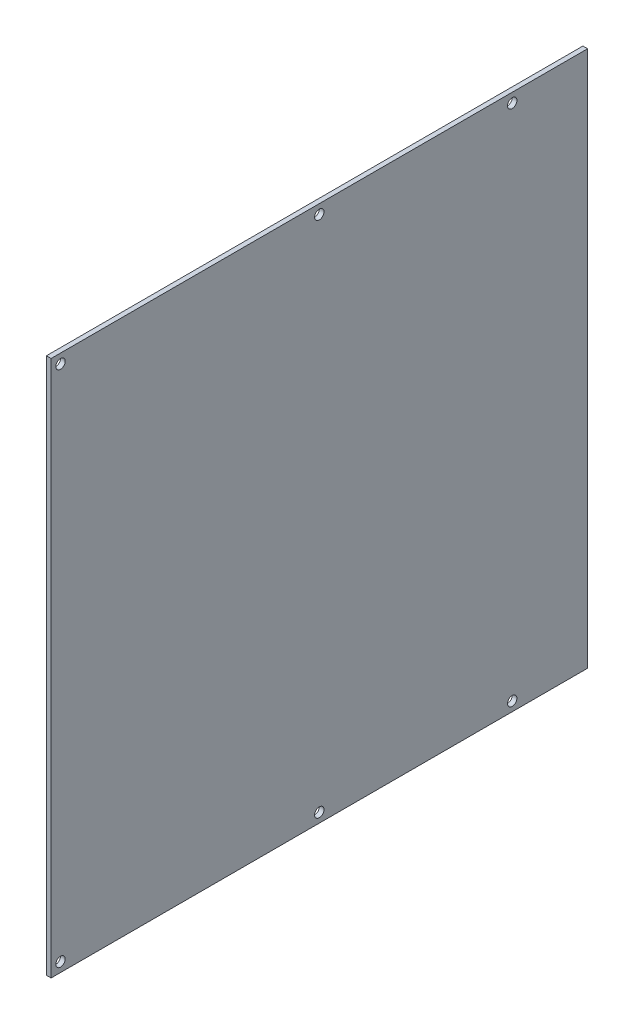
ISO-10303-21;
HEADER;
FILE_DESCRIPTION(('STEP AP214'),'2;1');
FILE_NAME('part.step','',(''),(''),'','','');
FILE_SCHEMA(('AUTOMOTIVE_DESIGN { 1 0 10303 214 1 1 1 1 }'));
ENDSEC;
DATA;
#1=APPLICATION_CONTEXT('core data for automotive mechanical design processes');
#2=APPLICATION_PROTOCOL_DEFINITION('international standard','automotive_design',2000,#1);
#3=PRODUCT_CONTEXT('',#1,'mechanical');
#4=PRODUCT('Part','Part','',(#3));
#5=PRODUCT_RELATED_PRODUCT_CATEGORY('part','',(#4));
#6=PRODUCT_DEFINITION_FORMATION('','',#4);
#7=PRODUCT_DEFINITION_CONTEXT('part definition',#1,'design');
#8=PRODUCT_DEFINITION('design','',#6,#7);
#9=PRODUCT_DEFINITION_SHAPE('','',#8);
#10=(LENGTH_UNIT() NAMED_UNIT(*) SI_UNIT(.MILLI.,.METRE.));
#11=(NAMED_UNIT(*) PLANE_ANGLE_UNIT() SI_UNIT($,.RADIAN.));
#12=(NAMED_UNIT(*) SI_UNIT($,.STERADIAN.) SOLID_ANGLE_UNIT());
#13=UNCERTAINTY_MEASURE_WITH_UNIT(LENGTH_MEASURE(1.E-05),#10,'distance_accuracy_value','');
#14=(GEOMETRIC_REPRESENTATION_CONTEXT(3) GLOBAL_UNCERTAINTY_ASSIGNED_CONTEXT((#13)) GLOBAL_UNIT_ASSIGNED_CONTEXT((#10,
#11,#12)) REPRESENTATION_CONTEXT('',''));
#15=CARTESIAN_POINT('',(0.,0.,0.));
#16=DIRECTION('',(0.,0.,1.));
#17=DIRECTION('',(1.,0.,0.));
#18=AXIS2_PLACEMENT_3D('',#15,#16,#17);
#19=CARTESIAN_POINT('',(-1219.2,177.877193641291,1597.025));
#20=DIRECTION('',(-1.,0.,0.));
#21=DIRECTION('',(0.,-1.,0.));
#22=AXIS2_PLACEMENT_3D('',#19,#20,#21);
#23=PLANE('',#22);
#24=CARTESIAN_POINT('',(-1219.2,352.50219364129,1771.65));
#25=DIRECTION('',(1.,0.,0.));
#26=DIRECTION('',(0.,1.,0.));
#27=AXIS2_PLACEMENT_3D('',#24,#25,#26);
#28=CIRCLE('',#27,3.175);
#29=CARTESIAN_POINT('',(-1219.2,355.67719364129,1771.65));
#30=VERTEX_POINT('',#29);
#31=EDGE_CURVE('E102',#30,#30,#28,.F.);
#32=ORIENTED_EDGE('',*,*,#31,.T.);
#33=EDGE_LOOP('',(#32));
#34=FACE_BOUND('',#33,.T.);
#35=CARTESIAN_POINT('',(-1219.2,352.50219364129,1466.91491037368));
#36=DIRECTION('',(1.,0.,0.));
#37=DIRECTION('',(0.,1.,0.));
#38=AXIS2_PLACEMENT_3D('',#35,#36,#37);
#39=CIRCLE('',#38,3.175);
#40=CARTESIAN_POINT('',(-1219.2,355.67719364129,1466.91491037368));
#41=VERTEX_POINT('',#40);
#42=EDGE_CURVE('E72',#41,#41,#39,.F.);
#43=ORIENTED_EDGE('',*,*,#42,.T.);
#44=EDGE_LOOP('',(#43));
#45=FACE_BOUND('',#44,.T.);
#46=CARTESIAN_POINT('',(-1219.2,352.50219364129,1597.06330442429));
#47=DIRECTION('',(1.,0.,0.));
#48=DIRECTION('',(0.,1.,0.));
#49=AXIS2_PLACEMENT_3D('',#46,#47,#48);
#50=CIRCLE('',#49,3.175);
#51=CARTESIAN_POINT('',(-1219.2,355.67719364129,1597.06330442429));
#52=VERTEX_POINT('',#51);
#53=EDGE_CURVE('E105',#52,#52,#50,.F.);
#54=ORIENTED_EDGE('',*,*,#53,.T.);
#55=EDGE_LOOP('',(#54));
#56=FACE_BOUND('',#55,.T.);
#57=DIRECTION('',(0.,0.,1.));
#58=VECTOR('',#57,1.);
#59=CARTESIAN_POINT('',(-1219.2,358.852193641291,1597.025));
#60=LINE('',#59,#58);
#61=CARTESIAN_POINT('',(-1219.2,358.852193641291,1416.05));
#62=VERTEX_POINT('',#61);
#63=CARTESIAN_POINT('',(-1219.2,358.852193641291,1778.));
#64=VERTEX_POINT('',#63);
#65=EDGE_CURVE('E111',#62,#64,#60,.T.);
#66=ORIENTED_EDGE('',*,*,#65,.T.);
#67=DIRECTION('',(0.,1.,0.));
#68=VECTOR('',#67,1.);
#69=CARTESIAN_POINT('',(-1219.2,179.3875,1778.));
#70=LINE('',#69,#68);
#71=CARTESIAN_POINT('',(-1219.2,-3.0978063587097,1778.));
#72=VERTEX_POINT('',#71);
#73=EDGE_CURVE('E296',#72,#64,#70,.T.);
#74=ORIENTED_EDGE('',*,*,#73,.F.);
#75=DIRECTION('',(0.,0.,1.));
#76=VECTOR('',#75,1.);
#77=CARTESIAN_POINT('',(-1219.2,-3.0978063587097,1597.61381511689));
#78=LINE('',#77,#76);
#79=CARTESIAN_POINT('',(-1219.2,-3.09780635870967,1416.12660884857));
#80=VERTEX_POINT('',#79);
#81=EDGE_CURVE('E58',#80,#72,#78,.T.);
#82=ORIENTED_EDGE('',*,*,#81,.F.);
#83=DIRECTION('',(0.,-0.999694352960379,0.0247224727551606));
#84=VECTOR('',#83,1.);
#85=CARTESIAN_POINT('',(-1219.2,-1.5489031793547,1416.08830442429));
#86=LINE('',#85,#84);
#87=CARTESIAN_POINT('',(-1219.2,3.33473438642795E-13,1416.05));
#88=VERTEX_POINT('',#87);
#89=EDGE_CURVE('E74',#80,#88,#86,.F.);
#90=ORIENTED_EDGE('',*,*,#89,.T.);
#91=DIRECTION('',(0.,1.,0.));
#92=VECTOR('',#91,1.);
#93=CARTESIAN_POINT('',(-1219.2,179.3875,1416.05));
#94=LINE('',#93,#92);
#95=EDGE_CURVE('E63',#88,#62,#94,.T.);
#96=ORIENTED_EDGE('',*,*,#95,.T.);
#97=EDGE_LOOP('',(#66,#74,#82,#90,#96));
#98=FACE_BOUND('',#97,.T.);
#99=CARTESIAN_POINT('',(-1219.2,3.25219364129064,1771.65));
#100=DIRECTION('',(1.,0.,0.));
#101=DIRECTION('',(0.,1.,0.));
#102=AXIS2_PLACEMENT_3D('',#99,#100,#101);
#103=CIRCLE('',#102,3.175);
#104=CARTESIAN_POINT('',(-1219.2,6.42719364129064,1771.65));
#105=VERTEX_POINT('',#104);
#106=EDGE_CURVE('E108',#105,#105,#103,.F.);
#107=ORIENTED_EDGE('',*,*,#106,.T.);
#108=EDGE_LOOP('',(#107));
#109=FACE_BOUND('',#108,.T.);
#110=CARTESIAN_POINT('',(-1219.2,3.25219364129064,1466.91491037368));
#111=DIRECTION('',(1.,0.,0.));
#112=DIRECTION('',(0.,1.,0.));
#113=AXIS2_PLACEMENT_3D('',#110,#111,#112);
#114=CIRCLE('',#113,3.175);
#115=CARTESIAN_POINT('',(-1219.2,6.42719364129064,1466.91491037368));
#116=VERTEX_POINT('',#115);
#117=EDGE_CURVE('E113',#116,#116,#114,.F.);
#118=ORIENTED_EDGE('',*,*,#117,.T.);
#119=EDGE_LOOP('',(#118));
#120=FACE_BOUND('',#119,.T.);
#121=CARTESIAN_POINT('',(-1219.2,3.25219364129061,1597.06330442429));
#122=DIRECTION('',(1.,0.,0.));
#123=DIRECTION('',(0.,1.,0.));
#124=AXIS2_PLACEMENT_3D('',#121,#122,#123);
#125=CIRCLE('',#124,3.175);
#126=CARTESIAN_POINT('',(-1219.2,6.42719364129061,1597.06330442429));
#127=VERTEX_POINT('',#126);
#128=EDGE_CURVE('E17',#127,#127,#125,.F.);
#129=ORIENTED_EDGE('',*,*,#128,.T.);
#130=EDGE_LOOP('',(#129));
#131=FACE_BOUND('',#130,.T.);
#132=ADVANCED_FACE('F14',(#34,#45,#56,#98,#109,#120,#131),#23,.F.);
#133=CARTESIAN_POINT('',(-1216.025,3.25219364129061,1597.06330442429));
#134=DIRECTION('',(1.,0.,0.));
#135=DIRECTION('',(0.,1.,0.));
#136=AXIS2_PLACEMENT_3D('',#133,#134,#135);
#137=CYLINDRICAL_SURFACE('',#136,3.175);
#138=ORIENTED_EDGE('',*,*,#128,.F.);
#139=EDGE_LOOP('',(#138));
#140=FACE_BOUND('',#139,.T.);
#141=CARTESIAN_POINT('',(-1222.375,3.25219364129061,1597.06330442429));
#142=DIRECTION('',(1.,0.,0.));
#143=DIRECTION('',(0.,1.,0.));
#144=AXIS2_PLACEMENT_3D('',#141,#142,#143);
#145=CIRCLE('',#144,3.175);
#146=CARTESIAN_POINT('',(-1222.375,6.42719364129061,1597.06330442429));
#147=VERTEX_POINT('',#146);
#148=EDGE_CURVE('E99',#147,#147,#145,.T.);
#149=ORIENTED_EDGE('',*,*,#148,.F.);
#150=EDGE_LOOP('',(#149));
#151=FACE_BOUND('',#150,.T.);
#152=ADVANCED_FACE('F121',(#140,#151),#137,.F.);
#153=CARTESIAN_POINT('',(-1216.025,3.25219364129064,1466.91491037368));
#154=DIRECTION('',(1.,0.,0.));
#155=DIRECTION('',(0.,1.,0.));
#156=AXIS2_PLACEMENT_3D('',#153,#154,#155);
#157=CYLINDRICAL_SURFACE('',#156,3.175);
#158=ORIENTED_EDGE('',*,*,#117,.F.);
#159=EDGE_LOOP('',(#158));
#160=FACE_BOUND('',#159,.T.);
#161=CARTESIAN_POINT('',(-1222.375,3.25219364129064,1466.91491037368));
#162=DIRECTION('',(1.,0.,0.));
#163=DIRECTION('',(0.,1.,0.));
#164=AXIS2_PLACEMENT_3D('',#161,#162,#163);
#165=CIRCLE('',#164,3.175);
#166=CARTESIAN_POINT('',(-1222.375,6.42719364129064,1466.91491037368));
#167=VERTEX_POINT('',#166);
#168=EDGE_CURVE('E96',#167,#167,#165,.T.);
#169=ORIENTED_EDGE('',*,*,#168,.F.);
#170=EDGE_LOOP('',(#169));
#171=FACE_BOUND('',#170,.T.);
#172=ADVANCED_FACE('F124',(#160,#171),#157,.F.);
#173=CARTESIAN_POINT('',(-1216.025,352.50219364129,1466.91491037368));
#174=DIRECTION('',(1.,0.,0.));
#175=DIRECTION('',(0.,1.,0.));
#176=AXIS2_PLACEMENT_3D('',#173,#174,#175);
#177=CYLINDRICAL_SURFACE('',#176,3.175);
#178=ORIENTED_EDGE('',*,*,#42,.F.);
#179=EDGE_LOOP('',(#178));
#180=FACE_BOUND('',#179,.T.);
#181=CARTESIAN_POINT('',(-1222.375,352.50219364129,1466.91491037368));
#182=DIRECTION('',(1.,0.,0.));
#183=DIRECTION('',(0.,1.,0.));
#184=AXIS2_PLACEMENT_3D('',#181,#182,#183);
#185=CIRCLE('',#184,3.175);
#186=CARTESIAN_POINT('',(-1222.375,355.67719364129,1466.91491037368));
#187=VERTEX_POINT('',#186);
#188=EDGE_CURVE('E92',#187,#187,#185,.T.);
#189=ORIENTED_EDGE('',*,*,#188,.F.);
#190=EDGE_LOOP('',(#189));
#191=FACE_BOUND('',#190,.T.);
#192=ADVANCED_FACE('F165',(#180,#191),#177,.F.);
#193=CARTESIAN_POINT('',(-1222.375,179.3875,1416.05));
#194=DIRECTION('',(0.,0.,1.));
#195=DIRECTION('',(1.,0.,0.));
#196=AXIS2_PLACEMENT_3D('',#193,#194,#195);
#197=PLANE('',#196);
#198=DIRECTION('',(1.,0.,0.));
#199=VECTOR('',#198,1.);
#200=CARTESIAN_POINT('',(-1222.375,4.16550474668931E-13,1416.05));
#201=LINE('',#200,#199);
#202=CARTESIAN_POINT('',(-1222.375,5.24470903315781E-12,1416.05));
#203=VERTEX_POINT('',#202);
#204=EDGE_CURVE('E66',#88,#203,#201,.F.);
#205=ORIENTED_EDGE('',*,*,#204,.T.);
#206=DIRECTION('',(0.,-1.,0.));
#207=VECTOR('',#206,1.);
#208=CARTESIAN_POINT('',(-1222.375,177.877193641291,1416.05));
#209=LINE('',#208,#207);
#210=CARTESIAN_POINT('',(-1222.375,358.852193641291,1416.05));
#211=VERTEX_POINT('',#210);
#212=EDGE_CURVE('E95',#211,#203,#209,.T.);
#213=ORIENTED_EDGE('',*,*,#212,.F.);
#214=DIRECTION('',(1.,0.,0.));
#215=VECTOR('',#214,1.);
#216=CARTESIAN_POINT('',(-1222.375,358.852193641291,1416.05));
#217=LINE('',#216,#215);
#218=EDGE_CURVE('E69',#211,#62,#217,.T.);
#219=ORIENTED_EDGE('',*,*,#218,.T.);
#220=ORIENTED_EDGE('',*,*,#95,.F.);
#221=EDGE_LOOP('',(#205,#213,#219,#220));
#222=FACE_BOUND('',#221,.T.);
#223=ADVANCED_FACE('F64',(#222),#197,.F.);
#224=CARTESIAN_POINT('',(-1222.375,-1.5489031793547,1416.08830442429));
#225=DIRECTION('',(0.,0.0247224727551606,0.999694352960379));
#226=DIRECTION('',(0.,-0.999694352960379,0.0247224727551606));
#227=AXIS2_PLACEMENT_3D('',#224,#225,#226);
#228=PLANE('',#227);
#229=DIRECTION('',(1.,0.,0.));
#230=VECTOR('',#229,1.);
#231=CARTESIAN_POINT('',(-1222.375,-3.09780635870971,1416.12660884857));
#232=LINE('',#231,#230);
#233=CARTESIAN_POINT('',(-1222.375,-3.09780635870963,1416.12660884857));
#234=VERTEX_POINT('',#233);
#235=EDGE_CURVE('E298',#234,#80,#232,.T.);
#236=ORIENTED_EDGE('',*,*,#235,.F.);
#237=DIRECTION('',(0.,-0.999694352960393,0.0247224727545877));
#238=VECTOR('',#237,1.);
#239=CARTESIAN_POINT('',(-1222.375,3.05311331771918E-13,1416.05));
#240=LINE('',#239,#238);
#241=EDGE_CURVE('E81',#203,#234,#240,.T.);
#242=ORIENTED_EDGE('',*,*,#241,.F.);
#243=ORIENTED_EDGE('',*,*,#204,.F.);
#244=ORIENTED_EDGE('',*,*,#89,.F.);
#245=EDGE_LOOP('',(#236,#242,#243,#244));
#246=FACE_BOUND('',#245,.T.);
#247=ADVANCED_FACE('F79',(#246),#228,.F.);
#248=CARTESIAN_POINT('',(-1222.375,-3.0978063587097,1597.61381511689));
#249=DIRECTION('',(0.,-1.,0.));
#250=DIRECTION('',(1.,0.,0.));
#251=AXIS2_PLACEMENT_3D('',#248,#249,#250);
#252=PLANE('',#251);
#253=DIRECTION('',(0.,0.,1.));
#254=VECTOR('',#253,1.);
#255=CARTESIAN_POINT('',(-1222.375,-3.09780635870971,1597.025));
#256=LINE('',#255,#254);
#257=CARTESIAN_POINT('',(-1222.375,-3.0978063587097,1778.));
#258=VERTEX_POINT('',#257);
#259=EDGE_CURVE('E283',#234,#258,#256,.T.);
#260=ORIENTED_EDGE('',*,*,#259,.F.);
#261=ORIENTED_EDGE('',*,*,#235,.T.);
#262=ORIENTED_EDGE('',*,*,#81,.T.);
#263=DIRECTION('',(1.,0.,0.));
#264=VECTOR('',#263,1.);
#265=CARTESIAN_POINT('',(-1222.375,-3.09780635870971,1778.));
#266=LINE('',#265,#264);
#267=EDGE_CURVE('E294',#258,#72,#266,.T.);
#268=ORIENTED_EDGE('',*,*,#267,.F.);
#269=EDGE_LOOP('',(#260,#261,#262,#268));
#270=FACE_BOUND('',#269,.T.);
#271=ADVANCED_FACE('F157',(#270),#252,.T.);
#272=CARTESIAN_POINT('',(-1222.375,179.3875,1778.));
#273=DIRECTION('',(0.,0.,1.));
#274=DIRECTION('',(1.,0.,0.));
#275=AXIS2_PLACEMENT_3D('',#272,#273,#274);
#276=PLANE('',#275);
#277=DIRECTION('',(0.,-1.,0.));
#278=VECTOR('',#277,1.);
#279=CARTESIAN_POINT('',(-1222.375,177.877193641291,1778.));
#280=LINE('',#279,#278);
#281=CARTESIAN_POINT('',(-1222.375,358.852193641291,1778.));
#282=VERTEX_POINT('',#281);
#283=EDGE_CURVE('E279',#258,#282,#280,.F.);
#284=ORIENTED_EDGE('',*,*,#283,.F.);
#285=ORIENTED_EDGE('',*,*,#267,.T.);
#286=ORIENTED_EDGE('',*,*,#73,.T.);
#287=DIRECTION('',(1.,0.,0.));
#288=VECTOR('',#287,1.);
#289=CARTESIAN_POINT('',(-1222.375,358.852193641291,1778.));
#290=LINE('',#289,#288);
#291=EDGE_CURVE('E32',#64,#282,#290,.F.);
#292=ORIENTED_EDGE('',*,*,#291,.T.);
#293=EDGE_LOOP('',(#284,#285,#286,#292));
#294=FACE_BOUND('',#293,.T.);
#295=ADVANCED_FACE('F153',(#294),#276,.T.);
#296=CARTESIAN_POINT('',(-1222.375,358.852193641291,1597.025));
#297=DIRECTION('',(0.,-1.,0.));
#298=DIRECTION('',(1.,0.,0.));
#299=AXIS2_PLACEMENT_3D('',#296,#297,#298);
#300=PLANE('',#299);
#301=ORIENTED_EDGE('',*,*,#218,.F.);
#302=DIRECTION('',(0.,0.,1.));
#303=VECTOR('',#302,1.);
#304=CARTESIAN_POINT('',(-1222.375,358.852193641291,1597.025));
#305=LINE('',#304,#303);
#306=EDGE_CURVE('E91',#282,#211,#305,.F.);
#307=ORIENTED_EDGE('',*,*,#306,.F.);
#308=ORIENTED_EDGE('',*,*,#291,.F.);
#309=ORIENTED_EDGE('',*,*,#65,.F.);
#310=EDGE_LOOP('',(#301,#307,#308,#309));
#311=FACE_BOUND('',#310,.T.);
#312=ADVANCED_FACE('F149',(#311),#300,.F.);
#313=CARTESIAN_POINT('',(-1216.025,3.25219364129064,1771.65));
#314=DIRECTION('',(1.,0.,0.));
#315=DIRECTION('',(0.,1.,0.));
#316=AXIS2_PLACEMENT_3D('',#313,#314,#315);
#317=CYLINDRICAL_SURFACE('',#316,3.175);
#318=ORIENTED_EDGE('',*,*,#106,.F.);
#319=EDGE_LOOP('',(#318));
#320=FACE_BOUND('',#319,.T.);
#321=CARTESIAN_POINT('',(-1222.375,3.25219364129064,1771.65));
#322=DIRECTION('',(1.,0.,0.));
#323=DIRECTION('',(0.,1.,0.));
#324=AXIS2_PLACEMENT_3D('',#321,#322,#323);
#325=CIRCLE('',#324,3.175);
#326=CARTESIAN_POINT('',(-1222.375,6.42719364129064,1771.65));
#327=VERTEX_POINT('',#326);
#328=EDGE_CURVE('E88',#327,#327,#325,.T.);
#329=ORIENTED_EDGE('',*,*,#328,.F.);
#330=EDGE_LOOP('',(#329));
#331=FACE_BOUND('',#330,.T.);
#332=ADVANCED_FACE('F145',(#320,#331),#317,.F.);
#333=CARTESIAN_POINT('',(-1216.025,352.50219364129,1597.06330442429));
#334=DIRECTION('',(1.,0.,0.));
#335=DIRECTION('',(0.,1.,0.));
#336=AXIS2_PLACEMENT_3D('',#333,#334,#335);
#337=CYLINDRICAL_SURFACE('',#336,3.175);
#338=ORIENTED_EDGE('',*,*,#53,.F.);
#339=EDGE_LOOP('',(#338));
#340=FACE_BOUND('',#339,.T.);
#341=CARTESIAN_POINT('',(-1222.375,352.50219364129,1597.06330442429));
#342=DIRECTION('',(1.,0.,0.));
#343=DIRECTION('',(0.,1.,0.));
#344=AXIS2_PLACEMENT_3D('',#341,#342,#343);
#345=CIRCLE('',#344,3.175);
#346=CARTESIAN_POINT('',(-1222.375,355.67719364129,1597.06330442429));
#347=VERTEX_POINT('',#346);
#348=EDGE_CURVE('E23',#347,#347,#345,.T.);
#349=ORIENTED_EDGE('',*,*,#348,.F.);
#350=EDGE_LOOP('',(#349));
#351=FACE_BOUND('',#350,.T.);
#352=ADVANCED_FACE('F138',(#340,#351),#337,.F.);
#353=CARTESIAN_POINT('',(-1216.025,352.50219364129,1771.65));
#354=DIRECTION('',(1.,0.,0.));
#355=DIRECTION('',(0.,1.,0.));
#356=AXIS2_PLACEMENT_3D('',#353,#354,#355);
#357=CYLINDRICAL_SURFACE('',#356,3.175);
#358=ORIENTED_EDGE('',*,*,#31,.F.);
#359=EDGE_LOOP('',(#358));
#360=FACE_BOUND('',#359,.T.);
#361=CARTESIAN_POINT('',(-1222.375,352.50219364129,1771.65));
#362=DIRECTION('',(1.,0.,0.));
#363=DIRECTION('',(0.,1.,0.));
#364=AXIS2_PLACEMENT_3D('',#361,#362,#363);
#365=CIRCLE('',#364,3.175);
#366=CARTESIAN_POINT('',(-1222.375,355.67719364129,1771.65));
#367=VERTEX_POINT('',#366);
#368=EDGE_CURVE('E9',#367,#367,#365,.T.);
#369=ORIENTED_EDGE('',*,*,#368,.F.);
#370=EDGE_LOOP('',(#369));
#371=FACE_BOUND('',#370,.T.);
#372=ADVANCED_FACE('F129',(#360,#371),#357,.F.);
#373=CARTESIAN_POINT('',(-1222.375,177.877193641291,1597.025));
#374=DIRECTION('',(-1.,0.,0.));
#375=DIRECTION('',(0.,-1.,0.));
#376=AXIS2_PLACEMENT_3D('',#373,#374,#375);
#377=PLANE('',#376);
#378=ORIENTED_EDGE('',*,*,#368,.T.);
#379=EDGE_LOOP('',(#378));
#380=FACE_BOUND('',#379,.T.);
#381=ORIENTED_EDGE('',*,*,#348,.T.);
#382=EDGE_LOOP('',(#381));
#383=FACE_BOUND('',#382,.T.);
#384=ORIENTED_EDGE('',*,*,#328,.T.);
#385=EDGE_LOOP('',(#384));
#386=FACE_BOUND('',#385,.T.);
#387=ORIENTED_EDGE('',*,*,#283,.T.);
#388=ORIENTED_EDGE('',*,*,#306,.T.);
#389=ORIENTED_EDGE('',*,*,#212,.T.);
#390=ORIENTED_EDGE('',*,*,#241,.T.);
#391=ORIENTED_EDGE('',*,*,#259,.T.);
#392=EDGE_LOOP('',(#387,#388,#389,#390,#391));
#393=FACE_BOUND('',#392,.T.);
#394=ORIENTED_EDGE('',*,*,#188,.T.);
#395=EDGE_LOOP('',(#394));
#396=FACE_BOUND('',#395,.T.);
#397=ORIENTED_EDGE('',*,*,#168,.T.);
#398=EDGE_LOOP('',(#397));
#399=FACE_BOUND('',#398,.T.);
#400=ORIENTED_EDGE('',*,*,#148,.T.);
#401=EDGE_LOOP('',(#400));
#402=FACE_BOUND('',#401,.T.);
#403=ADVANCED_FACE('F127',(#380,#383,#386,#393,#396,#399,#402),#377,.T.);
#404=CLOSED_SHELL('',(#132,#152,#172,#192,#223,#247,#271,#295,#312,#332,#352,#372,#403));
#405=MANIFOLD_SOLID_BREP('B1',#404);
#406=ADVANCED_BREP_SHAPE_REPRESENTATION('',(#18,#405),#14);
#407=SHAPE_DEFINITION_REPRESENTATION(#9,#406);
ENDSEC;
END-ISO-10303-21;
